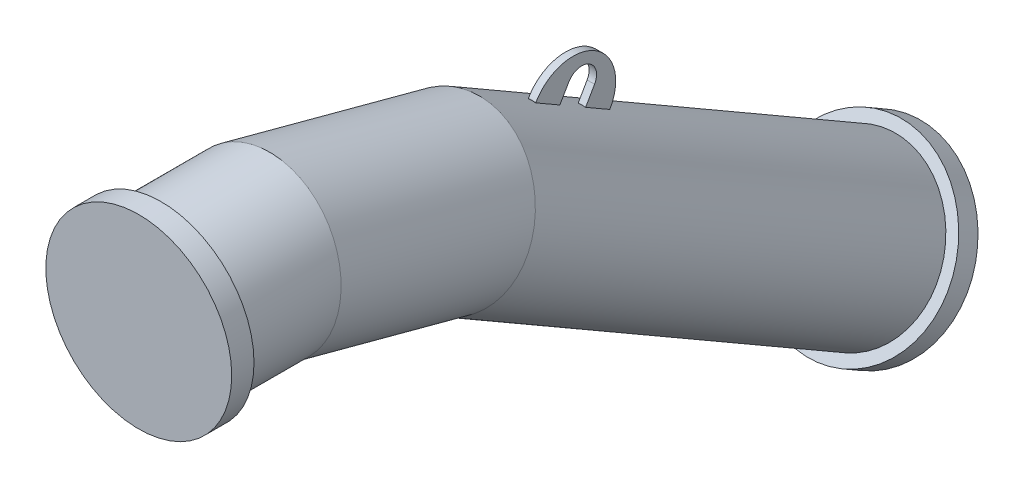
ISO-10303-21;
HEADER;
FILE_DESCRIPTION(('STEP AP214'),'2;1');
FILE_NAME('part.step','',(''),(''),'','','');
FILE_SCHEMA(('AUTOMOTIVE_DESIGN { 1 0 10303 214 1 1 1 1 }'));
ENDSEC;
DATA;
#1=APPLICATION_CONTEXT('core data for automotive mechanical design processes');
#2=APPLICATION_PROTOCOL_DEFINITION('international standard','automotive_design',2000,#1);
#3=PRODUCT_CONTEXT('',#1,'mechanical');
#4=PRODUCT('Part','Part','',(#3));
#5=PRODUCT_RELATED_PRODUCT_CATEGORY('part','',(#4));
#6=PRODUCT_DEFINITION_FORMATION('','',#4);
#7=PRODUCT_DEFINITION_CONTEXT('part definition',#1,'design');
#8=PRODUCT_DEFINITION('design','',#6,#7);
#9=PRODUCT_DEFINITION_SHAPE('','',#8);
#10=(LENGTH_UNIT() NAMED_UNIT(*) SI_UNIT(.MILLI.,.METRE.));
#11=(NAMED_UNIT(*) PLANE_ANGLE_UNIT() SI_UNIT($,.RADIAN.));
#12=(NAMED_UNIT(*) SI_UNIT($,.STERADIAN.) SOLID_ANGLE_UNIT());
#13=UNCERTAINTY_MEASURE_WITH_UNIT(LENGTH_MEASURE(1.E-05),#10,'distance_accuracy_value','');
#14=(GEOMETRIC_REPRESENTATION_CONTEXT(3) GLOBAL_UNCERTAINTY_ASSIGNED_CONTEXT((#13)) GLOBAL_UNIT_ASSIGNED_CONTEXT((#10,
#11,#12)) REPRESENTATION_CONTEXT('',''));
#15=CARTESIAN_POINT('',(0.,0.,0.));
#16=DIRECTION('',(0.,0.,1.));
#17=DIRECTION('',(1.,0.,0.));
#18=AXIS2_PLACEMENT_3D('',#15,#16,#17);
#19=CARTESIAN_POINT('',(0.,0.,0.));
#20=DIRECTION('',(0.,0.,1.));
#21=DIRECTION('',(1.,0.,0.));
#22=AXIS2_PLACEMENT_3D('',#19,#20,#21);
#23=PLANE('',#22);
#24=CARTESIAN_POINT('',(0.,0.,0.));
#25=DIRECTION('',(0.,0.,1.));
#26=DIRECTION('',(1.,0.,0.));
#27=AXIS2_PLACEMENT_3D('',#24,#25,#26);
#28=CIRCLE('',#27,125.);
#29=CARTESIAN_POINT('',(125.,0.,0.));
#30=VERTEX_POINT('',#29);
#31=EDGE_CURVE('E21',#30,#30,#28,.T.);
#32=ORIENTED_EDGE('',*,*,#31,.T.);
#33=EDGE_LOOP('',(#32));
#34=FACE_BOUND('',#33,.T.);
#35=ADVANCED_FACE('F17',(#34),#23,.T.);
#36=CARTESIAN_POINT('',(0.,-3.33066907387547E-13,-30.0000000000004));
#37=DIRECTION('',(0.,0.,1.));
#38=DIRECTION('',(1.,0.,0.));
#39=AXIS2_PLACEMENT_3D('',#36,#37,#38);
#40=CYLINDRICAL_SURFACE('',#39,125.);
#41=CARTESIAN_POINT('',(0.,-3.33066907387547E-13,-30.0000000000004));
#42=DIRECTION('',(0.,0.,1.));
#43=DIRECTION('',(1.,0.,0.));
#44=AXIS2_PLACEMENT_3D('',#41,#42,#43);
#45=CIRCLE('',#44,125.);
#46=CARTESIAN_POINT('',(125.,-3.65253148460731E-13,-30.0000000000004));
#47=VERTEX_POINT('',#46);
#48=EDGE_CURVE('E28',#47,#47,#45,.T.);
#49=ORIENTED_EDGE('',*,*,#48,.T.);
#50=EDGE_LOOP('',(#49));
#51=FACE_BOUND('',#50,.T.);
#52=ORIENTED_EDGE('',*,*,#31,.F.);
#53=EDGE_LOOP('',(#52));
#54=FACE_BOUND('',#53,.T.);
#55=ADVANCED_FACE('F19',(#51,#54),#40,.T.);
#56=CARTESIAN_POINT('',(0.,-3.33066907387547E-13,-30.0000000000004));
#57=DIRECTION('',(0.,0.,1.));
#58=DIRECTION('',(1.,0.,0.));
#59=AXIS2_PLACEMENT_3D('',#56,#57,#58);
#60=PLANE('',#59);
#61=CARTESIAN_POINT('',(0.,0.,-30.));
#62=DIRECTION('',(0.,0.,-1.));
#63=DIRECTION('',(-1.,0.,0.));
#64=AXIS2_PLACEMENT_3D('',#61,#62,#63);
#65=CIRCLE('',#64,109.55);
#66=CARTESIAN_POINT('',(-109.55,0.,-30.));
#67=VERTEX_POINT('',#66);
#68=EDGE_CURVE('E10',#67,#67,#65,.T.);
#69=ORIENTED_EDGE('',*,*,#68,.F.);
#70=EDGE_LOOP('',(#69));
#71=FACE_BOUND('',#70,.T.);
#72=ORIENTED_EDGE('',*,*,#48,.F.);
#73=EDGE_LOOP('',(#72));
#74=FACE_BOUND('',#73,.T.);
#75=ADVANCED_FACE('F390',(#71,#74),#60,.F.);
#76=CARTESIAN_POINT('',(5.00000000000025,-14.8602048103285,-590.687822173513));
#77=DIRECTION('',(1.,0.,0.));
#78=DIRECTION('',(0.,0.866025403784438,-0.500000000000001));
#79=AXIS2_PLACEMENT_3D('',#76,#77,#78);
#80=PLANE('',#79);
#81=DIRECTION('',(0.,0.866025403784438,-0.500000000000001));
#82=VECTOR('',#81,1.);
#83=CARTESIAN_POINT('',(5.00000000000026,-15.1220558371067,-524.141361455907));
#84=LINE('',#83,#82);
#85=CARTESIAN_POINT('',(5.00000000000026,-6.95038097216386,-528.859280138912));
#86=VERTEX_POINT('',#85);
#87=CARTESIAN_POINT('',(5.00000000000026,-6.46180179926234,-529.141361455907));
#88=VERTEX_POINT('',#87);
#89=EDGE_CURVE('E317',#86,#88,#84,.T.);
#90=ORIENTED_EDGE('',*,*,#89,.F.);
#91=DIRECTION('',(0.,-0.499999999999995,-0.866025403784429));
#92=VECTOR('',#91,1.);
#93=CARTESIAN_POINT('',(5.00000000000012,-223.374132178468,-903.716213192874));
#94=LINE('',#93,#92);
#95=CARTESIAN_POINT('',(5.00000000000024,-25.7003809721672,-561.335232780832));
#96=VERTEX_POINT('',#95);
#97=EDGE_CURVE('E53',#86,#96,#94,.T.);
#98=ORIENTED_EDGE('',*,*,#97,.T.);
#99=DIRECTION('',(0.,0.866025403784439,-0.500000000000002));
#100=VECTOR('',#99,1.);
#101=CARTESIAN_POINT('',(5.00000000000025,-25.2118017992627,-561.617314097824));
#102=LINE('',#101,#100);
#103=CARTESIAN_POINT('',(5.00000000000025,-4.86020481032828,-573.367314097824));
#104=VERTEX_POINT('',#103);
#105=EDGE_CURVE('E330',#96,#104,#102,.T.);
#106=ORIENTED_EDGE('',*,*,#105,.T.);
#107=CARTESIAN_POINT('',(5.00000000000025,-14.8602048103285,-590.687822173513));
#108=DIRECTION('',(-1.,0.,0.));
#109=DIRECTION('',(0.,0.866025403784438,-0.500000000000001));
#110=AXIS2_PLACEMENT_3D('',#107,#108,#109);
#111=CIRCLE('',#110,20.);
#112=CARTESIAN_POINT('',(5.00000000000023,-24.8602048103283,-608.008330249202));
#113=VERTEX_POINT('',#112);
#114=EDGE_CURVE('E333',#104,#113,#111,.T.);
#115=ORIENTED_EDGE('',*,*,#114,.T.);
#116=DIRECTION('',(0.,-0.866025403784438,0.500000000000001));
#117=VECTOR('',#116,1.);
#118=CARTESIAN_POINT('',(5.00000000000023,-45.2118017992629,-596.258330249202));
#119=LINE('',#118,#117);
#120=CARTESIAN_POINT('',(5.00000000000022,-45.7003809721671,-595.976248932209));
#121=VERTEX_POINT('',#120);
#122=EDGE_CURVE('E337',#113,#121,#119,.T.);
#123=ORIENTED_EDGE('',*,*,#122,.T.);
#124=CARTESIAN_POINT('',(5.00000000000023,-64.4503809721643,-628.452201574123));
#125=VERTEX_POINT('',#124);
#126=EDGE_CURVE('E307',#121,#125,#94,.T.);
#127=ORIENTED_EDGE('',*,*,#126,.T.);
#128=DIRECTION('',(0.,0.866025403784438,-0.500000000000001));
#129=VECTOR('',#128,1.);
#130=CARTESIAN_POINT('',(5.00000000000023,-72.6220558371072,-623.734282891118));
#131=LINE('',#130,#129);
#132=CARTESIAN_POINT('',(5.00000000000023,-63.9618017992628,-628.734282891118));
#133=VERTEX_POINT('',#132);
#134=EDGE_CURVE('E323',#125,#133,#131,.T.);
#135=ORIENTED_EDGE('',*,*,#134,.T.);
#136=CARTESIAN_POINT('',(5.00000000000024,-35.2118017992626,-578.937822173513));
#137=DIRECTION('',(1.,0.,0.));
#138=DIRECTION('',(0.,0.866025403784438,-0.500000000000001));
#139=AXIS2_PLACEMENT_3D('',#136,#137,#138);
#140=CIRCLE('',#139,57.5);
#141=EDGE_CURVE('E340',#133,#88,#140,.T.);
#142=ORIENTED_EDGE('',*,*,#141,.T.);
#143=EDGE_LOOP('',(#90,#98,#106,#115,#123,#127,#135,#142));
#144=FACE_BOUND('',#143,.T.);
#145=ADVANCED_FACE('F396',(#144),#80,.T.);
#146=CARTESIAN_POINT('',(-4.99999999999976,-14.8602048103285,-590.687822173513));
#147=DIRECTION('',(1.,0.,0.));
#148=DIRECTION('',(0.,0.866025403784438,-0.500000000000001));
#149=AXIS2_PLACEMENT_3D('',#146,#147,#148);
#150=PLANE('',#149);
#151=DIRECTION('',(0.,-0.499999999999995,-0.866025403784429));
#152=VECTOR('',#151,1.);
#153=CARTESIAN_POINT('',(-4.99999999999988,-223.374132178468,-903.716213192874));
#154=LINE('',#153,#152);
#155=CARTESIAN_POINT('',(-4.99999999999974,-6.95038097216381,-528.859280138912));
#156=VERTEX_POINT('',#155);
#157=CARTESIAN_POINT('',(-4.99999999999976,-25.7003809721672,-561.335232780832));
#158=VERTEX_POINT('',#157);
#159=EDGE_CURVE('E299',#156,#158,#154,.T.);
#160=ORIENTED_EDGE('',*,*,#159,.F.);
#161=DIRECTION('',(0.,0.866025403784438,-0.500000000000001));
#162=VECTOR('',#161,1.);
#163=CARTESIAN_POINT('',(-4.99999999999974,-15.1220558371067,-524.141361455907));
#164=LINE('',#163,#162);
#165=CARTESIAN_POINT('',(-4.99999999999974,-6.46180179926234,-529.141361455907));
#166=VERTEX_POINT('',#165);
#167=EDGE_CURVE('E320',#156,#166,#164,.T.);
#168=ORIENTED_EDGE('',*,*,#167,.T.);
#169=CARTESIAN_POINT('',(-4.99999999999976,-35.2118017992626,-578.937822173513));
#170=DIRECTION('',(1.,0.,0.));
#171=DIRECTION('',(0.,0.866025403784438,-0.500000000000001));
#172=AXIS2_PLACEMENT_3D('',#169,#170,#171);
#173=CIRCLE('',#172,57.5);
#174=CARTESIAN_POINT('',(-4.99999999999977,-63.9618017992628,-628.734282891118));
#175=VERTEX_POINT('',#174);
#176=EDGE_CURVE('E334',#175,#166,#173,.T.);
#177=ORIENTED_EDGE('',*,*,#176,.F.);
#178=DIRECTION('',(0.,0.866025403784438,-0.500000000000001));
#179=VECTOR('',#178,1.);
#180=CARTESIAN_POINT('',(-4.99999999999977,-72.6220558371072,-623.734282891118));
#181=LINE('',#180,#179);
#182=CARTESIAN_POINT('',(-4.99999999999977,-64.4503809721642,-628.452201574123));
#183=VERTEX_POINT('',#182);
#184=EDGE_CURVE('E326',#183,#175,#181,.T.);
#185=ORIENTED_EDGE('',*,*,#184,.F.);
#186=CARTESIAN_POINT('',(-4.99999999999978,-45.7003809721671,-595.976248932209));
#187=VERTEX_POINT('',#186);
#188=EDGE_CURVE('E303',#187,#183,#154,.T.);
#189=ORIENTED_EDGE('',*,*,#188,.F.);
#190=DIRECTION('',(0.,-0.866025403784438,0.500000000000001));
#191=VECTOR('',#190,1.);
#192=CARTESIAN_POINT('',(-4.99999999999977,-45.2118017992629,-596.258330249202));
#193=LINE('',#192,#191);
#194=CARTESIAN_POINT('',(-4.99999999999977,-24.8602048103283,-608.008330249202));
#195=VERTEX_POINT('',#194);
#196=EDGE_CURVE('E350',#195,#187,#193,.T.);
#197=ORIENTED_EDGE('',*,*,#196,.F.);
#198=CARTESIAN_POINT('',(-4.99999999999976,-14.8602048103285,-590.687822173513));
#199=DIRECTION('',(-1.,0.,0.));
#200=DIRECTION('',(0.,0.866025403784438,-0.500000000000001));
#201=AXIS2_PLACEMENT_3D('',#198,#199,#200);
#202=CIRCLE('',#201,20.);
#203=CARTESIAN_POINT('',(-4.99999999999975,-4.86020481032834,-573.367314097824));
#204=VERTEX_POINT('',#203);
#205=EDGE_CURVE('E347',#204,#195,#202,.T.);
#206=ORIENTED_EDGE('',*,*,#205,.F.);
#207=DIRECTION('',(0.,0.866025403784439,-0.500000000000002));
#208=VECTOR('',#207,1.);
#209=CARTESIAN_POINT('',(-4.99999999999975,-25.2118017992627,-561.617314097824));
#210=LINE('',#209,#208);
#211=EDGE_CURVE('E329',#158,#204,#210,.T.);
#212=ORIENTED_EDGE('',*,*,#211,.F.);
#213=EDGE_LOOP('',(#160,#168,#177,#185,#189,#197,#206,#212));
#214=FACE_BOUND('',#213,.T.);
#215=ADVANCED_FACE('F406',(#214),#150,.F.);
#216=CARTESIAN_POINT('',(5.00000000000025,-25.2118017992627,-561.617314097824));
#217=DIRECTION('',(0.,0.500000000000002,0.866025403784439));
#218=DIRECTION('',(0.,-0.866025403784439,0.500000000000002));
#219=AXIS2_PLACEMENT_3D('',#216,#217,#218);
#220=PLANE('',#219);
#221=CARTESIAN_POINT('',(-1.42014403945222E-13,-120.474596215552,-506.617314097823));
#222=DIRECTION('',(0.,0.500000000000002,0.866025403784439));
#223=DIRECTION('',(0.,-0.866025403784438,0.500000000000001));
#224=AXIS2_PLACEMENT_3D('',#221,#222,#223);
#225=CIRCLE('',#224,109.55);
#226=EDGE_CURVE('E306',#158,#96,#225,.F.);
#227=ORIENTED_EDGE('',*,*,#226,.F.);
#228=ORIENTED_EDGE('',*,*,#211,.T.);
#229=DIRECTION('',(-1.,0.,0.));
#230=VECTOR('',#229,1.);
#231=CARTESIAN_POINT('',(5.00000000000025,-4.86020481032828,-573.367314097824));
#232=LINE('',#231,#230);
#233=EDGE_CURVE('E367',#104,#204,#232,.T.);
#234=ORIENTED_EDGE('',*,*,#233,.F.);
#235=ORIENTED_EDGE('',*,*,#105,.F.);
#236=EDGE_LOOP('',(#227,#228,#234,#235));
#237=FACE_BOUND('',#236,.T.);
#238=ADVANCED_FACE('F402',(#237),#220,.F.);
#239=CARTESIAN_POINT('',(5.00000000000025,-14.8602048103285,-590.687822173513));
#240=DIRECTION('',(-1.,0.,0.));
#241=DIRECTION('',(0.,-0.866025403784438,0.500000000000001));
#242=AXIS2_PLACEMENT_3D('',#239,#240,#241);
#243=CYLINDRICAL_SURFACE('',#242,20.);
#244=ORIENTED_EDGE('',*,*,#205,.T.);
#245=DIRECTION('',(-1.,0.,0.));
#246=VECTOR('',#245,1.);
#247=CARTESIAN_POINT('',(5.00000000000023,-24.8602048103283,-608.008330249202));
#248=LINE('',#247,#246);
#249=EDGE_CURVE('E363',#113,#195,#248,.T.);
#250=ORIENTED_EDGE('',*,*,#249,.F.);
#251=ORIENTED_EDGE('',*,*,#114,.F.);
#252=ORIENTED_EDGE('',*,*,#233,.T.);
#253=EDGE_LOOP('',(#244,#250,#251,#252));
#254=FACE_BOUND('',#253,.T.);
#255=ADVANCED_FACE('F405',(#254),#243,.F.);
#256=CARTESIAN_POINT('',(5.00000000000023,-45.2118017992629,-596.258330249202));
#257=DIRECTION('',(0.,-0.500000000000001,-0.866025403784438));
#258=DIRECTION('',(0.,0.866025403784438,-0.500000000000001));
#259=AXIS2_PLACEMENT_3D('',#256,#257,#258);
#260=PLANE('',#259);
#261=CARTESIAN_POINT('',(-1.52674128869724E-13,-140.474596215552,-541.258330249201));
#262=DIRECTION('',(0.,-0.500000000000001,-0.866025403784438));
#263=DIRECTION('',(0.,0.866025403784438,-0.500000000000001));
#264=AXIS2_PLACEMENT_3D('',#261,#262,#263);
#265=CIRCLE('',#264,109.55);
#266=EDGE_CURVE('E41',#121,#187,#265,.F.);
#267=ORIENTED_EDGE('',*,*,#266,.F.);
#268=ORIENTED_EDGE('',*,*,#122,.F.);
#269=ORIENTED_EDGE('',*,*,#249,.T.);
#270=ORIENTED_EDGE('',*,*,#196,.T.);
#271=EDGE_LOOP('',(#267,#268,#269,#270));
#272=FACE_BOUND('',#271,.T.);
#273=ADVANCED_FACE('F410',(#272),#260,.F.);
#274=CARTESIAN_POINT('',(5.00000000000024,-35.2118017992626,-578.937822173513));
#275=DIRECTION('',(-1.,0.,0.));
#276=DIRECTION('',(0.,-0.866025403784438,0.500000000000001));
#277=AXIS2_PLACEMENT_3D('',#274,#275,#276);
#278=CYLINDRICAL_SURFACE('',#277,57.5);
#279=ORIENTED_EDGE('',*,*,#176,.T.);
#280=DIRECTION('',(-1.,0.,0.));
#281=VECTOR('',#280,1.);
#282=CARTESIAN_POINT('',(5.00000000000026,-6.46180179926234,-529.141361455907));
#283=LINE('',#282,#281);
#284=EDGE_CURVE('E344',#88,#166,#283,.T.);
#285=ORIENTED_EDGE('',*,*,#284,.F.);
#286=ORIENTED_EDGE('',*,*,#141,.F.);
#287=DIRECTION('',(-1.,0.,0.));
#288=VECTOR('',#287,1.);
#289=CARTESIAN_POINT('',(5.00000000000023,-63.9618017992628,-628.734282891118));
#290=LINE('',#289,#288);
#291=EDGE_CURVE('E359',#133,#175,#290,.T.);
#292=ORIENTED_EDGE('',*,*,#291,.T.);
#293=EDGE_LOOP('',(#279,#285,#286,#292));
#294=FACE_BOUND('',#293,.T.);
#295=ADVANCED_FACE('F414',(#294),#278,.T.);
#296=CARTESIAN_POINT('',(-4.99999999999977,-72.6220558371072,-623.734282891118));
#297=DIRECTION('',(0.,0.500000000000001,0.866025403784438));
#298=DIRECTION('',(0.,-0.866025403784438,0.500000000000001));
#299=AXIS2_PLACEMENT_3D('',#296,#297,#298);
#300=PLANE('',#299);
#301=CARTESIAN_POINT('',(-1.62667620986445E-13,-159.224596215552,-573.734282891117));
#302=DIRECTION('',(0.,0.500000000000001,0.866025403784438));
#303=DIRECTION('',(0.,-0.866025403784438,0.500000000000001));
#304=AXIS2_PLACEMENT_3D('',#301,#302,#303);
#305=CIRCLE('',#304,109.55);
#306=EDGE_CURVE('E311',#183,#125,#305,.F.);
#307=ORIENTED_EDGE('',*,*,#306,.F.);
#308=ORIENTED_EDGE('',*,*,#184,.T.);
#309=ORIENTED_EDGE('',*,*,#291,.F.);
#310=ORIENTED_EDGE('',*,*,#134,.F.);
#311=EDGE_LOOP('',(#307,#308,#309,#310));
#312=FACE_BOUND('',#311,.T.);
#313=ADVANCED_FACE('F417',(#312),#300,.F.);
#314=CARTESIAN_POINT('',(5.00000000000026,-15.1220558371067,-524.141361455907));
#315=DIRECTION('',(0.,-0.500000000000001,-0.866025403784438));
#316=DIRECTION('',(0.,0.866025403784438,-0.500000000000001));
#317=AXIS2_PLACEMENT_3D('',#314,#315,#316);
#318=PLANE('',#317);
#319=CARTESIAN_POINT('',(-1.32020911828501E-13,-101.724596215552,-474.141361455906));
#320=DIRECTION('',(0.,-0.500000000000001,-0.866025403784438));
#321=DIRECTION('',(0.,0.866025403784438,-0.500000000000001));
#322=AXIS2_PLACEMENT_3D('',#319,#320,#321);
#323=CIRCLE('',#322,109.55);
#324=EDGE_CURVE('E371',#86,#156,#323,.F.);
#325=ORIENTED_EDGE('',*,*,#324,.F.);
#326=ORIENTED_EDGE('',*,*,#89,.T.);
#327=ORIENTED_EDGE('',*,*,#284,.T.);
#328=ORIENTED_EDGE('',*,*,#167,.F.);
#329=EDGE_LOOP('',(#325,#326,#327,#328));
#330=FACE_BOUND('',#329,.T.);
#331=ADVANCED_FACE('F426',(#330),#318,.F.);
#332=CARTESIAN_POINT('',(-2.47371794577906E-13,-318.148347421854,-848.998294509869));
#333=DIRECTION('',(0.,-0.499999999999995,-0.866025403784429));
#334=DIRECTION('',(-1.,0.,0.));
#335=AXIS2_PLACEMENT_3D('',#332,#333,#334);
#336=CYLINDRICAL_SURFACE('',#335,109.55);
#337=CARTESIAN_POINT('',(-2.82456279825538E-13,-383.974596215551,-963.012701892223));
#338=DIRECTION('',(0.,0.499999999999995,0.866025403784429));
#339=DIRECTION('',(1.,0.,0.));
#340=AXIS2_PLACEMENT_3D('',#337,#338,#339);
#341=CIRCLE('',#340,109.55);
#342=CARTESIAN_POINT('',(109.55,-383.974596215552,-963.012701892223));
#343=VERTEX_POINT('',#342);
#344=EDGE_CURVE('E284',#343,#343,#341,.T.);
#345=ORIENTED_EDGE('',*,*,#344,.T.);
#346=EDGE_LOOP('',(#345));
#347=FACE_BOUND('',#346,.T.);
#348=CARTESIAN_POINT('',(0.,-68.1483474218638,-415.985592617647));
#349=DIRECTION('',(0.,-0.38268343236509,-0.923879532511287));
#350=DIRECTION('',(0.,-0.923879532511287,0.38268343236509));
#351=AXIS2_PLACEMENT_3D('',#348,#349,#350);
#352=ELLIPSE('',#351,110.495302631556,109.55);
#353=CARTESIAN_POINT('',(0.,-170.232695961799,-373.700870946383));
#354=VERTEX_POINT('',#353);
#355=EDGE_CURVE('E291',#354,#354,#352,.T.);
#356=ORIENTED_EDGE('',*,*,#355,.T.);
#357=EDGE_LOOP('',(#356));
#358=FACE_BOUND('',#357,.T.);
#359=ORIENTED_EDGE('',*,*,#159,.T.);
#360=ORIENTED_EDGE('',*,*,#226,.T.);
#361=ORIENTED_EDGE('',*,*,#97,.F.);
#362=ORIENTED_EDGE('',*,*,#324,.T.);
#363=EDGE_LOOP('',(#359,#360,#361,#362));
#364=FACE_BOUND('',#363,.T.);
#365=ORIENTED_EDGE('',*,*,#126,.F.);
#366=ORIENTED_EDGE('',*,*,#266,.T.);
#367=ORIENTED_EDGE('',*,*,#188,.T.);
#368=ORIENTED_EDGE('',*,*,#306,.T.);
#369=EDGE_LOOP('',(#365,#366,#367,#368));
#370=FACE_BOUND('',#369,.T.);
#371=ADVANCED_FACE('F430',(#347,#358,#364,#370),#336,.T.);
#372=CARTESIAN_POINT('',(0.,0.,-161.652497587396));
#373=DIRECTION('',(0.,0.,1.));
#374=DIRECTION('',(1.,0.,0.));
#375=AXIS2_PLACEMENT_3D('',#372,#373,#374);
#376=CYLINDRICAL_SURFACE('',#375,109.55);
#377=ORIENTED_EDGE('',*,*,#68,.T.);
#378=EDGE_LOOP('',(#377));
#379=FACE_BOUND('',#378,.T.);
#380=CARTESIAN_POINT('',(0.,0.,-161.652497587396));
#381=DIRECTION('',(0.,-0.130526192220052,-0.99144486137381));
#382=DIRECTION('',(0.,-0.99144486137381,0.130526192220052));
#383=AXIS2_PLACEMENT_3D('',#380,#381,#382);
#384=ELLIPSE('',#383,110.495302631556,109.55);
#385=CARTESIAN_POINT('',(0.,-109.55,-147.229966476697));
#386=VERTEX_POINT('',#385);
#387=EDGE_CURVE('E294',#386,#386,#384,.T.);
#388=ORIENTED_EDGE('',*,*,#387,.F.);
#389=EDGE_LOOP('',(#388));
#390=FACE_BOUND('',#389,.T.);
#391=ADVANCED_FACE('F432',(#379,#390),#376,.T.);
#392=CARTESIAN_POINT('',(0.,-68.1483474218638,-415.985592617647));
#393=DIRECTION('',(0.,0.258819045102521,0.965925826289068));
#394=DIRECTION('',(0.,-0.965925826289068,0.258819045102521));
#395=AXIS2_PLACEMENT_3D('',#392,#393,#394);
#396=CYLINDRICAL_SURFACE('',#395,109.55);
#397=ORIENTED_EDGE('',*,*,#355,.F.);
#398=EDGE_LOOP('',(#397));
#399=FACE_BOUND('',#398,.T.);
#400=ORIENTED_EDGE('',*,*,#387,.T.);
#401=EDGE_LOOP('',(#400));
#402=FACE_BOUND('',#401,.T.);
#403=ADVANCED_FACE('F435',(#399,#402),#396,.T.);
#404=CARTESIAN_POINT('',(-2.61312604657219E-13,-383.97459621555,-963.012701892224));
#405=DIRECTION('',(0.,-0.500000000000002,-0.866025403784442));
#406=DIRECTION('',(1.,0.,0.));
#407=AXIS2_PLACEMENT_3D('',#404,#405,#406);
#408=CYLINDRICAL_SURFACE('',#407,125.);
#409=CARTESIAN_POINT('',(-2.61312604657219E-13,-383.97459621555,-963.012701892224));
#410=DIRECTION('',(0.,-0.500000000000002,-0.866025403784442));
#411=DIRECTION('',(1.,0.,0.));
#412=AXIS2_PLACEMENT_3D('',#409,#410,#411);
#413=CIRCLE('',#412,125.);
#414=CARTESIAN_POINT('',(125.,-383.97459621555,-963.012701892224));
#415=VERTEX_POINT('',#414);
#416=EDGE_CURVE('E280',#415,#415,#413,.T.);
#417=ORIENTED_EDGE('',*,*,#416,.T.);
#418=EDGE_LOOP('',(#417));
#419=FACE_BOUND('',#418,.T.);
#420=CARTESIAN_POINT('',(-2.69190720448067E-13,-398.974596215551,-988.993464005757));
#421=DIRECTION('',(0.,-0.500000000000002,-0.866025403784442));
#422=DIRECTION('',(1.,0.,0.));
#423=AXIS2_PLACEMENT_3D('',#420,#421,#422);
#424=CIRCLE('',#423,125.);
#425=CARTESIAN_POINT('',(125.,-398.974596215551,-988.993464005757));
#426=VERTEX_POINT('',#425);
#427=EDGE_CURVE('E279',#426,#426,#424,.T.);
#428=ORIENTED_EDGE('',*,*,#427,.F.);
#429=EDGE_LOOP('',(#428));
#430=FACE_BOUND('',#429,.T.);
#431=ADVANCED_FACE('F439',(#419,#430),#408,.T.);
#432=CARTESIAN_POINT('',(-2.61312604657219E-13,-383.97459621555,-963.012701892224));
#433=DIRECTION('',(0.,-0.500000000000002,-0.866025403784442));
#434=DIRECTION('',(1.,0.,0.));
#435=AXIS2_PLACEMENT_3D('',#432,#433,#434);
#436=PLANE('',#435);
#437=ORIENTED_EDGE('',*,*,#344,.F.);
#438=EDGE_LOOP('',(#437));
#439=FACE_BOUND('',#438,.T.);
#440=ORIENTED_EDGE('',*,*,#416,.F.);
#441=EDGE_LOOP('',(#440));
#442=FACE_BOUND('',#441,.T.);
#443=ADVANCED_FACE('F446',(#439,#442),#436,.F.);
#444=CARTESIAN_POINT('',(-2.69190720448067E-13,-398.974596215551,-988.993464005757));
#445=DIRECTION('',(0.,-0.500000000000002,-0.866025403784442));
#446=DIRECTION('',(1.,0.,0.));
#447=AXIS2_PLACEMENT_3D('',#444,#445,#446);
#448=PLANE('',#447);
#449=ORIENTED_EDGE('',*,*,#427,.T.);
#450=EDGE_LOOP('',(#449));
#451=FACE_BOUND('',#450,.T.);
#452=ADVANCED_FACE('F448',(#451),#448,.T.);
#453=CLOSED_SHELL('',(#35,#55,#75,#145,#215,#238,#255,#273,#295,#313,#331,#371,#391,#403,#431,
#443,#452));
#454=CARTESIAN_POINT('',(-2.62625623955694E-13,-386.474596215551,-967.342828911146));
#455=DIRECTION('',(0.,-0.5,-0.866025403784439));
#456=DIRECTION('',(0.,0.866025403784438,-0.5));
#457=AXIS2_PLACEMENT_3D('',#454,#455,#456);
#458=PLANE('',#457);
#459=CARTESIAN_POINT('',(-2.62625623955694E-13,-386.474596215551,-967.342828911146));
#460=DIRECTION('',(0.,-0.5,-0.866025403784439));
#461=DIRECTION('',(0.,0.866025403784438,-0.5));
#462=AXIS2_PLACEMENT_3D('',#459,#460,#461);
#463=CIRCLE('',#462,62.5);
#464=CARTESIAN_POINT('',(-2.62625623955694E-13,-332.348008479023,-998.592828911146));
#465=VERTEX_POINT('',#464);
#466=EDGE_CURVE('E264',#465,#465,#463,.F.);
#467=ORIENTED_EDGE('',*,*,#466,.T.);
#468=EDGE_LOOP('',(#467));
#469=FACE_BOUND('',#468,.T.);
#470=ADVANCED_FACE('F471',(#469),#458,.F.);
#471=CARTESIAN_POINT('',(0.,-3.33066907387547E-13,-30.0000000000004));
#472=DIRECTION('',(0.,0.,1.));
#473=DIRECTION('',(1.,0.,0.));
#474=AXIS2_PLACEMENT_3D('',#471,#472,#473);
#475=PLANE('',#474);
#476=CARTESIAN_POINT('',(0.,-3.33066907387547E-13,-30.0000000000004));
#477=DIRECTION('',(0.,0.,1.));
#478=DIRECTION('',(1.,0.,0.));
#479=AXIS2_PLACEMENT_3D('',#476,#477,#478);
#480=CIRCLE('',#479,62.5);
#481=CARTESIAN_POINT('',(62.5,-3.49160027924139E-13,-30.0000000000004));
#482=VERTEX_POINT('',#481);
#483=EDGE_CURVE('E205',#482,#482,#480,.T.);
#484=ORIENTED_EDGE('',*,*,#483,.T.);
#485=EDGE_LOOP('',(#484));
#486=FACE_BOUND('',#485,.T.);
#487=CARTESIAN_POINT('',(0.,0.,-30.));
#488=DIRECTION('',(0.,0.,-0.999999999999997));
#489=DIRECTION('',(0.,1.,0.));
#490=AXIS2_PLACEMENT_3D('',#487,#488,#489);
#491=CIRCLE('',#490,63.5);
#492=CARTESIAN_POINT('',(0.,63.499999999995,-30.));
#493=VERTEX_POINT('',#492);
#494=EDGE_CURVE('E259',#493,#493,#491,.T.);
#495=ORIENTED_EDGE('',*,*,#494,.T.);
#496=EDGE_LOOP('',(#495));
#497=FACE_BOUND('',#496,.T.);
#498=ADVANCED_FACE('F459',(#486,#497),#475,.F.);
#499=CARTESIAN_POINT('',(0.,-1000.,-29.9999999999994));
#500=DIRECTION('',(-1.,0.,0.));
#501=DIRECTION('',(0.,0.,0.999999999999997));
#502=AXIS2_PLACEMENT_3D('',#499,#500,#501);
#503=TOROIDAL_SURFACE('',#502,1000.,63.5);
#504=CARTESIAN_POINT('',(0.,-133.974596215561,-529.999999999999));
#505=DIRECTION('',(0.,0.5,0.866025403784435));
#506=DIRECTION('',(0.,0.86602540378444,-0.500000000000004));
#507=AXIS2_PLACEMENT_3D('',#504,#505,#506);
#508=CIRCLE('',#507,63.5);
#509=CARTESIAN_POINT('',(0.,-78.9819830752533,-561.749999999997));
#510=VERTEX_POINT('',#509);
#511=EDGE_CURVE('E269',#510,#510,#508,.T.);
#512=CARTESIAN_POINT('',(0.,-1000.,-29.9999999999994));
#513=DIRECTION('',(-1.,0.,0.));
#514=DIRECTION('',(0.,0.,0.999999999999997));
#515=AXIS2_PLACEMENT_3D('',#512,#513,#514);
#516=CIRCLE('',#515,1063.5);
#517=EDGE_CURVE('',#493,#510,#516,.T.);
#518=ORIENTED_EDGE('',*,*,#494,.F.);
#519=ORIENTED_EDGE('',*,*,#511,.F.);
#520=ORIENTED_EDGE('',*,*,#517,.T.);
#521=ORIENTED_EDGE('',*,*,#517,.F.);
#522=EDGE_LOOP('',(#518,#520,#519,#521));
#523=FACE_BOUND('',#522,.T.);
#524=ADVANCED_FACE('F455',(#523),#503,.F.);
#525=CARTESIAN_POINT('',(-1.24506302033142E-13,-133.974596215551,-530.000000000004));
#526=DIRECTION('',(0.,-0.500000000000001,-0.866025403784437));
#527=DIRECTION('',(-0.999999999999999,0.,0.));
#528=AXIS2_PLACEMENT_3D('',#525,#526,#527);
#529=CYLINDRICAL_SURFACE('',#528,63.5);
#530=ORIENTED_EDGE('',*,*,#511,.T.);
#531=EDGE_LOOP('',(#530));
#532=FACE_BOUND('',#531,.T.);
#533=CARTESIAN_POINT('',(-2.44242952996274E-13,-383.974596215552,-963.012701892223));
#534=DIRECTION('',(0.,0.500000000000001,0.866025403784437));
#535=DIRECTION('',(0.999999999999999,0.,0.));
#536=AXIS2_PLACEMENT_3D('',#533,#534,#535);
#537=CIRCLE('',#536,63.5);
#538=CARTESIAN_POINT('',(63.4999999999997,-383.974596215552,-963.012701892223));
#539=VERTEX_POINT('',#538);
#540=EDGE_CURVE('E265',#539,#539,#537,.T.);
#541=ORIENTED_EDGE('',*,*,#540,.F.);
#542=EDGE_LOOP('',(#541));
#543=FACE_BOUND('',#542,.T.);
#544=ADVANCED_FACE('F458',(#532,#543),#529,.F.);
#545=CARTESIAN_POINT('',(-2.61312604657219E-13,-383.97459621555,-963.012701892224));
#546=DIRECTION('',(0.,-0.500000000000002,-0.866025403784442));
#547=DIRECTION('',(1.,0.,0.));
#548=AXIS2_PLACEMENT_3D('',#545,#546,#547);
#549=PLANE('',#548);
#550=CARTESIAN_POINT('',(-2.61312604657219E-13,-383.97459621555,-963.012701892224));
#551=DIRECTION('',(0.,-0.500000000000002,-0.866025403784442));
#552=DIRECTION('',(1.,0.,0.));
#553=AXIS2_PLACEMENT_3D('',#550,#551,#552);
#554=CIRCLE('',#553,62.5);
#555=CARTESIAN_POINT('',(62.4999999999997,-383.97459621555,-963.012701892224));
#556=VERTEX_POINT('',#555);
#557=EDGE_CURVE('E260',#556,#556,#554,.T.);
#558=ORIENTED_EDGE('',*,*,#557,.T.);
#559=EDGE_LOOP('',(#558));
#560=FACE_BOUND('',#559,.T.);
#561=ORIENTED_EDGE('',*,*,#540,.T.);
#562=EDGE_LOOP('',(#561));
#563=FACE_BOUND('',#562,.T.);
#564=ADVANCED_FACE('F464',(#560,#563),#549,.F.);
#565=CARTESIAN_POINT('',(-2.61312604657219E-13,-383.97459621555,-963.012701892224));
#566=DIRECTION('',(0.,-0.500000000000002,-0.866025403784442));
#567=DIRECTION('',(1.,0.,0.));
#568=AXIS2_PLACEMENT_3D('',#565,#566,#567);
#569=CYLINDRICAL_SURFACE('',#568,62.5);
#570=ORIENTED_EDGE('',*,*,#557,.F.);
#571=EDGE_LOOP('',(#570));
#572=FACE_BOUND('',#571,.T.);
#573=ORIENTED_EDGE('',*,*,#466,.F.);
#574=EDGE_LOOP('',(#573));
#575=FACE_BOUND('',#574,.T.);
#576=ADVANCED_FACE('F466',(#572,#575),#569,.F.);
#577=CARTESIAN_POINT('',(0.,0.,-25.));
#578=DIRECTION('',(0.,0.,1.));
#579=DIRECTION('',(1.,0.,0.));
#580=AXIS2_PLACEMENT_3D('',#577,#578,#579);
#581=PLANE('',#580);
#582=CARTESIAN_POINT('',(0.,-3.33066907387547E-13,-25.));
#583=DIRECTION('',(0.,0.,1.));
#584=DIRECTION('',(1.,0.,0.));
#585=AXIS2_PLACEMENT_3D('',#582,#583,#584);
#586=CIRCLE('',#585,62.5);
#587=CARTESIAN_POINT('',(62.5,-3.33066907387547E-13,-25.));
#588=VERTEX_POINT('',#587);
#589=EDGE_CURVE('E204',#588,#588,#586,.F.);
#590=ORIENTED_EDGE('',*,*,#589,.T.);
#591=EDGE_LOOP('',(#590));
#592=FACE_BOUND('',#591,.T.);
#593=ADVANCED_FACE('F469',(#592),#581,.F.);
#594=CARTESIAN_POINT('',(0.,-3.33066907387547E-13,-30.0000000000004));
#595=DIRECTION('',(0.,0.,1.));
#596=DIRECTION('',(1.,0.,0.));
#597=AXIS2_PLACEMENT_3D('',#594,#595,#596);
#598=CYLINDRICAL_SURFACE('',#597,62.5);
#599=ORIENTED_EDGE('',*,*,#483,.F.);
#600=EDGE_LOOP('',(#599));
#601=FACE_BOUND('',#600,.T.);
#602=ORIENTED_EDGE('',*,*,#589,.F.);
#603=EDGE_LOOP('',(#602));
#604=FACE_BOUND('',#603,.T.);
#605=ADVANCED_FACE('F613',(#601,#604),#598,.F.);
#606=CLOSED_SHELL('',(#470,#498,#524,#544,#564,#576,#593,#605));
#607=CARTESIAN_POINT('',(-97.0073509136853,-352.176170941813,-988.299734514098));
#608=DIRECTION('',(0.,-0.500000000000002,-0.866025403784442));
#609=DIRECTION('',(0.,0.866025403784439,-0.5));
#610=AXIS2_PLACEMENT_3D('',#607,#608,#609);
#611=PLANE('',#610);
#612=CARTESIAN_POINT('',(-97.0073509136853,-352.176170941813,-988.299734514098));
#613=DIRECTION('',(0.,-0.500000000000002,-0.866025403784442));
#614=DIRECTION('',(1.,0.,0.));
#615=AXIS2_PLACEMENT_3D('',#612,#613,#614);
#616=CIRCLE('',#615,6.99999999999999);
#617=CARTESIAN_POINT('',(-90.0073509136853,-352.176170941813,-988.299734514098));
#618=VERTEX_POINT('',#617);
#619=EDGE_CURVE('E216',#618,#618,#616,.T.);
#620=ORIENTED_EDGE('',*,*,#619,.F.);
#621=EDGE_LOOP('',(#620));
#622=FACE_BOUND('',#621,.T.);
#623=ADVANCED_FACE('F531',(#622),#611,.F.);
#624=CARTESIAN_POINT('',(-97.0073509136853,-352.176170941813,-988.299734514098));
#625=DIRECTION('',(0.,-0.500000000000002,-0.866025403784442));
#626=DIRECTION('',(1.,0.,0.));
#627=AXIS2_PLACEMENT_3D('',#624,#625,#626);
#628=CONICAL_SURFACE('',#627,6.99999999999999,1.02974425867665);
#629=CARTESIAN_POINT('',(-97.0073509136853,-350.073158775217,-984.657210592617));
#630=VERTEX_POINT('',#629);
#631=VERTEX_LOOP('',#630);
#632=FACE_BOUND('',#631,.T.);
#633=ORIENTED_EDGE('',*,*,#619,.T.);
#634=EDGE_LOOP('',(#633));
#635=FACE_BOUND('',#634,.T.);
#636=ADVANCED_FACE('F534',(#632,#635),#628,.F.);
#637=CLOSED_SHELL('',(#623,#636));
#638=CARTESIAN_POINT('',(-97.0073509136856,40.1817603983326,-24.0000000000009));
#639=DIRECTION('',(0.,0.,1.));
#640=DIRECTION('',(0.,-1.,0.));
#641=AXIS2_PLACEMENT_3D('',#638,#639,#640);
#642=PLANE('',#641);
#643=CARTESIAN_POINT('',(-97.0073509136856,40.1817603983326,-24.0000000000009));
#644=DIRECTION('',(0.,0.,1.));
#645=DIRECTION('',(1.,0.,0.));
#646=AXIS2_PLACEMENT_3D('',#643,#644,#645);
#647=CIRCLE('',#646,6.99999999999999);
#648=CARTESIAN_POINT('',(-90.0073509136856,40.1817603983326,-24.0000000000009));
#649=VERTEX_POINT('',#648);
#650=EDGE_CURVE('E233',#649,#649,#647,.T.);
#651=ORIENTED_EDGE('',*,*,#650,.F.);
#652=EDGE_LOOP('',(#651));
#653=FACE_BOUND('',#652,.T.);
#654=ADVANCED_FACE('F541',(#653),#642,.F.);
#655=CARTESIAN_POINT('',(-97.0073509136856,40.1817603983326,-24.0000000000009));
#656=DIRECTION('',(0.,0.,1.));
#657=DIRECTION('',(1.,0.,0.));
#658=AXIS2_PLACEMENT_3D('',#655,#656,#657);
#659=CONICAL_SURFACE('',#658,6.99999999999999,1.02974425867665);
#660=CARTESIAN_POINT('',(-97.0073509136856,40.1817603983329,-28.2060243331936));
#661=VERTEX_POINT('',#660);
#662=VERTEX_LOOP('',#661);
#663=FACE_BOUND('',#662,.T.);
#664=ORIENTED_EDGE('',*,*,#650,.T.);
#665=EDGE_LOOP('',(#664));
#666=FACE_BOUND('',#665,.T.);
#667=ADVANCED_FACE('F544',(#663,#666),#659,.F.);
#668=CLOSED_SHELL('',(#654,#667));
#669=CARTESIAN_POINT('',(-40.1817603983355,97.0073509136849,-24.0000000000002));
#670=DIRECTION('',(0.,0.,1.));
#671=DIRECTION('',(0.,-1.,0.));
#672=AXIS2_PLACEMENT_3D('',#669,#670,#671);
#673=PLANE('',#672);
#674=CARTESIAN_POINT('',(-40.1817603983355,97.0073509136849,-24.0000000000002));
#675=DIRECTION('',(0.,0.,1.));
#676=DIRECTION('',(1.,0.,0.));
#677=AXIS2_PLACEMENT_3D('',#674,#675,#676);
#678=CIRCLE('',#677,6.99999999999999);
#679=CARTESIAN_POINT('',(-33.1817603983355,97.0073509136849,-24.0000000000002));
#680=VERTEX_POINT('',#679);
#681=EDGE_CURVE('E229',#680,#680,#678,.T.);
#682=ORIENTED_EDGE('',*,*,#681,.F.);
#683=EDGE_LOOP('',(#682));
#684=FACE_BOUND('',#683,.T.);
#685=ADVANCED_FACE('F551',(#684),#673,.F.);
#686=CARTESIAN_POINT('',(-40.1817603983355,97.0073509136849,-24.0000000000002));
#687=DIRECTION('',(0.,0.,1.));
#688=DIRECTION('',(1.,0.,0.));
#689=AXIS2_PLACEMENT_3D('',#686,#687,#688);
#690=CONICAL_SURFACE('',#689,6.99999999999999,1.02974425867665);
#691=CARTESIAN_POINT('',(-40.1817603983355,97.0073509136846,-28.2060243331932));
#692=VERTEX_POINT('',#691);
#693=VERTEX_LOOP('',#692);
#694=FACE_BOUND('',#693,.T.);
#695=ORIENTED_EDGE('',*,*,#681,.T.);
#696=EDGE_LOOP('',(#695));
#697=FACE_BOUND('',#696,.T.);
#698=ADVANCED_FACE('F554',(#694,#697),#690,.F.);
#699=CLOSED_SHELL('',(#685,#698));
#700=CARTESIAN_POINT('',(40.1817603983335,97.0073509136856,-24.));
#701=DIRECTION('',(0.,0.,1.));
#702=DIRECTION('',(0.,-1.,0.));
#703=AXIS2_PLACEMENT_3D('',#700,#701,#702);
#704=PLANE('',#703);
#705=CARTESIAN_POINT('',(40.1817603983335,97.0073509136856,-24.));
#706=DIRECTION('',(0.,0.,1.));
#707=DIRECTION('',(1.,0.,0.));
#708=AXIS2_PLACEMENT_3D('',#705,#706,#707);
#709=CIRCLE('',#708,6.99999999999999);
#710=CARTESIAN_POINT('',(47.1817603983335,97.0073509136856,-24.));
#711=VERTEX_POINT('',#710);
#712=EDGE_CURVE('E224',#711,#711,#709,.T.);
#713=ORIENTED_EDGE('',*,*,#712,.F.);
#714=EDGE_LOOP('',(#713));
#715=FACE_BOUND('',#714,.T.);
#716=ADVANCED_FACE('F561',(#715),#704,.F.);
#717=CARTESIAN_POINT('',(40.1817603983335,97.0073509136856,-24.));
#718=DIRECTION('',(0.,0.,1.));
#719=DIRECTION('',(1.,0.,0.));
#720=AXIS2_PLACEMENT_3D('',#717,#718,#719);
#721=CONICAL_SURFACE('',#720,6.99999999999999,1.02974425867665);
#722=CARTESIAN_POINT('',(40.1817603983335,97.0073509136856,-28.2060243331932));
#723=VERTEX_POINT('',#722);
#724=VERTEX_LOOP('',#723);
#725=FACE_BOUND('',#724,.T.);
#726=ORIENTED_EDGE('',*,*,#712,.T.);
#727=EDGE_LOOP('',(#726));
#728=FACE_BOUND('',#727,.T.);
#729=ADVANCED_FACE('F564',(#725,#728),#721,.F.);
#730=CLOSED_SHELL('',(#716,#729));
#731=CARTESIAN_POINT('',(97.0073509136848,40.1817603983347,-24.0000000000007));
#732=DIRECTION('',(0.,0.,1.));
#733=DIRECTION('',(0.,-1.,0.));
#734=AXIS2_PLACEMENT_3D('',#731,#732,#733);
#735=PLANE('',#734);
#736=CARTESIAN_POINT('',(97.0073509136848,40.1817603983347,-24.0000000000007));
#737=DIRECTION('',(0.,0.,1.));
#738=DIRECTION('',(1.,0.,0.));
#739=AXIS2_PLACEMENT_3D('',#736,#737,#738);
#740=CIRCLE('',#739,6.99999999999999);
#741=CARTESIAN_POINT('',(104.007350913685,40.1817603983347,-24.0000000000007));
#742=VERTEX_POINT('',#741);
#743=EDGE_CURVE('E228',#742,#742,#740,.T.);
#744=ORIENTED_EDGE('',*,*,#743,.F.);
#745=EDGE_LOOP('',(#744));
#746=FACE_BOUND('',#745,.T.);
#747=ADVANCED_FACE('F491',(#746),#735,.F.);
#748=CARTESIAN_POINT('',(97.0073509136848,40.1817603983347,-24.0000000000007));
#749=DIRECTION('',(0.,0.,1.));
#750=DIRECTION('',(1.,0.,0.));
#751=AXIS2_PLACEMENT_3D('',#748,#749,#750);
#752=CONICAL_SURFACE('',#751,6.99999999999999,1.02974425867665);
#753=CARTESIAN_POINT('',(97.0073509136848,40.1817603983351,-28.2060243331939));
#754=VERTEX_POINT('',#753);
#755=VERTEX_LOOP('',#754);
#756=FACE_BOUND('',#755,.T.);
#757=ORIENTED_EDGE('',*,*,#743,.T.);
#758=EDGE_LOOP('',(#757));
#759=FACE_BOUND('',#758,.T.);
#760=ADVANCED_FACE('F494',(#756,#759),#752,.F.);
#761=CLOSED_SHELL('',(#747,#760));
#762=CARTESIAN_POINT('',(97.0073509136854,-40.1817603983341,-24.0000000000002));
#763=DIRECTION('',(0.,0.,1.));
#764=DIRECTION('',(0.,-1.,0.));
#765=AXIS2_PLACEMENT_3D('',#762,#763,#764);
#766=PLANE('',#765);
#767=CARTESIAN_POINT('',(97.0073509136854,-40.1817603983341,-24.0000000000002));
#768=DIRECTION('',(0.,0.,1.));
#769=DIRECTION('',(1.,0.,0.));
#770=AXIS2_PLACEMENT_3D('',#767,#768,#769);
#771=CIRCLE('',#770,6.99999999999999);
#772=CARTESIAN_POINT('',(104.007350913685,-40.1817603983341,-24.0000000000002));
#773=VERTEX_POINT('',#772);
#774=EDGE_CURVE('E249',#773,#773,#771,.T.);
#775=ORIENTED_EDGE('',*,*,#774,.F.);
#776=EDGE_LOOP('',(#775));
#777=FACE_BOUND('',#776,.T.);
#778=ADVANCED_FACE('F501',(#777),#766,.F.);
#779=CARTESIAN_POINT('',(97.0073509136854,-40.1817603983341,-24.0000000000002));
#780=DIRECTION('',(0.,0.,1.));
#781=DIRECTION('',(1.,0.,0.));
#782=AXIS2_PLACEMENT_3D('',#779,#780,#781);
#783=CONICAL_SURFACE('',#782,6.99999999999999,1.02974425867665);
#784=CARTESIAN_POINT('',(97.0073509136854,-40.1817603983341,-28.2060243331927));
#785=VERTEX_POINT('',#784);
#786=VERTEX_LOOP('',#785);
#787=FACE_BOUND('',#786,.T.);
#788=ORIENTED_EDGE('',*,*,#774,.T.);
#789=EDGE_LOOP('',(#788));
#790=FACE_BOUND('',#789,.T.);
#791=ADVANCED_FACE('F504',(#787,#790),#783,.F.);
#792=CLOSED_SHELL('',(#778,#791));
#793=CARTESIAN_POINT('',(40.1817603983348,-97.0073509136851,-24.0000000000007));
#794=DIRECTION('',(0.,0.,1.));
#795=DIRECTION('',(0.,-1.,0.));
#796=AXIS2_PLACEMENT_3D('',#793,#794,#795);
#797=PLANE('',#796);
#798=CARTESIAN_POINT('',(40.1817603983348,-97.0073509136851,-24.0000000000007));
#799=DIRECTION('',(0.,0.,1.));
#800=DIRECTION('',(1.,0.,0.));
#801=AXIS2_PLACEMENT_3D('',#798,#799,#800);
#802=CIRCLE('',#801,6.99999999999999);
#803=CARTESIAN_POINT('',(47.1817603983348,-97.0073509136851,-24.0000000000007));
#804=VERTEX_POINT('',#803);
#805=EDGE_CURVE('E245',#804,#804,#802,.T.);
#806=ORIENTED_EDGE('',*,*,#805,.F.);
#807=EDGE_LOOP('',(#806));
#808=FACE_BOUND('',#807,.T.);
#809=ADVANCED_FACE('F511',(#808),#797,.F.);
#810=CARTESIAN_POINT('',(40.1817603983348,-97.0073509136851,-24.0000000000007));
#811=DIRECTION('',(0.,0.,1.));
#812=DIRECTION('',(1.,0.,0.));
#813=AXIS2_PLACEMENT_3D('',#810,#811,#812);
#814=CONICAL_SURFACE('',#813,6.99999999999999,1.02974425867665);
#815=CARTESIAN_POINT('',(40.1817603983348,-97.0073509136851,-28.206024333193));
#816=VERTEX_POINT('',#815);
#817=VERTEX_LOOP('',#816);
#818=FACE_BOUND('',#817,.T.);
#819=ORIENTED_EDGE('',*,*,#805,.T.);
#820=EDGE_LOOP('',(#819));
#821=FACE_BOUND('',#820,.T.);
#822=ADVANCED_FACE('F514',(#818,#821),#814,.F.);
#823=CLOSED_SHELL('',(#809,#822));
#824=CARTESIAN_POINT('',(-40.1817603983342,-97.0073509136857,-24.0000000000011));
#825=DIRECTION('',(0.,0.,1.));
#826=DIRECTION('',(0.,-1.,0.));
#827=AXIS2_PLACEMENT_3D('',#824,#825,#826);
#828=PLANE('',#827);
#829=CARTESIAN_POINT('',(-40.1817603983342,-97.0073509136857,-24.0000000000011));
#830=DIRECTION('',(0.,0.,1.));
#831=DIRECTION('',(1.,0.,0.));
#832=AXIS2_PLACEMENT_3D('',#829,#830,#831);
#833=CIRCLE('',#832,6.99999999999999);
#834=CARTESIAN_POINT('',(-33.1817603983342,-97.0073509136857,-24.0000000000011));
#835=VERTEX_POINT('',#834);
#836=EDGE_CURVE('E240',#835,#835,#833,.T.);
#837=ORIENTED_EDGE('',*,*,#836,.F.);
#838=EDGE_LOOP('',(#837));
#839=FACE_BOUND('',#838,.T.);
#840=ADVANCED_FACE('F521',(#839),#828,.F.);
#841=CARTESIAN_POINT('',(-40.1817603983342,-97.0073509136857,-24.0000000000011));
#842=DIRECTION('',(0.,0.,1.));
#843=DIRECTION('',(1.,0.,0.));
#844=AXIS2_PLACEMENT_3D('',#841,#842,#843);
#845=CONICAL_SURFACE('',#844,6.99999999999999,1.02974425867665);
#846=CARTESIAN_POINT('',(-40.1817603983342,-97.0073509136857,-28.2060243331936));
#847=VERTEX_POINT('',#846);
#848=VERTEX_LOOP('',#847);
#849=FACE_BOUND('',#848,.T.);
#850=ORIENTED_EDGE('',*,*,#836,.T.);
#851=EDGE_LOOP('',(#850));
#852=FACE_BOUND('',#851,.T.);
#853=ADVANCED_FACE('F524',(#849,#852),#845,.F.);
#854=CLOSED_SHELL('',(#840,#853));
#855=CARTESIAN_POINT('',(-97.0073509136859,-421.773021489286,-948.117974115763));
#856=DIRECTION('',(0.,-0.500000000000002,-0.866025403784442));
#857=DIRECTION('',(0.,0.866025403784439,-0.5));
#858=AXIS2_PLACEMENT_3D('',#855,#856,#857);
#859=PLANE('',#858);
#860=CARTESIAN_POINT('',(-97.0073509136859,-421.773021489286,-948.117974115763));
#861=DIRECTION('',(0.,-0.500000000000002,-0.866025403784442));
#862=DIRECTION('',(1.,0.,0.));
#863=AXIS2_PLACEMENT_3D('',#860,#861,#862);
#864=CIRCLE('',#863,6.99999999999999);
#865=CARTESIAN_POINT('',(-90.0073509136859,-421.773021489286,-948.117974115763));
#866=VERTEX_POINT('',#865);
#867=EDGE_CURVE('E198',#866,#866,#864,.T.);
#868=ORIENTED_EDGE('',*,*,#867,.F.);
#869=EDGE_LOOP('',(#868));
#870=FACE_BOUND('',#869,.T.);
#871=ADVANCED_FACE('F618',(#870),#859,.F.);
#872=CARTESIAN_POINT('',(-97.0073509136859,-421.773021489286,-948.117974115763));
#873=DIRECTION('',(0.,-0.500000000000002,-0.866025403784442));
#874=DIRECTION('',(1.,0.,0.));
#875=AXIS2_PLACEMENT_3D('',#872,#873,#874);
#876=CONICAL_SURFACE('',#875,6.99999999999999,1.02974425867665);
#877=CARTESIAN_POINT('',(-97.0073509136859,-419.67000932269,-944.475450194283));
#878=VERTEX_POINT('',#877);
#879=VERTEX_LOOP('',#878);
#880=FACE_BOUND('',#879,.T.);
#881=ORIENTED_EDGE('',*,*,#867,.T.);
#882=EDGE_LOOP('',(#881));
#883=FACE_BOUND('',#882,.T.);
#884=ADVANCED_FACE('F621',(#880,#883),#876,.F.);
#885=CLOSED_SHELL('',(#871,#884));
#886=CARTESIAN_POINT('',(-40.1817603983358,-470.985426460633,-919.705178858088));
#887=DIRECTION('',(0.,-0.500000000000002,-0.866025403784442));
#888=DIRECTION('',(0.,0.866025403784439,-0.5));
#889=AXIS2_PLACEMENT_3D('',#886,#887,#888);
#890=PLANE('',#889);
#891=CARTESIAN_POINT('',(-40.1817603983358,-470.985426460633,-919.705178858088));
#892=DIRECTION('',(0.,-0.500000000000002,-0.866025403784442));
#893=DIRECTION('',(1.,0.,0.));
#894=AXIS2_PLACEMENT_3D('',#891,#892,#893);
#895=CIRCLE('',#894,6.99999999999999);
#896=CARTESIAN_POINT('',(-33.1817603983358,-470.985426460633,-919.705178858088));
#897=VERTEX_POINT('',#896);
#898=EDGE_CURVE('E187',#897,#897,#895,.T.);
#899=ORIENTED_EDGE('',*,*,#898,.F.);
#900=EDGE_LOOP('',(#899));
#901=FACE_BOUND('',#900,.T.);
#902=ADVANCED_FACE('F628',(#901),#890,.F.);
#903=CARTESIAN_POINT('',(-40.1817603983358,-470.985426460633,-919.705178858088));
#904=DIRECTION('',(0.,-0.500000000000002,-0.866025403784442));
#905=DIRECTION('',(1.,0.,0.));
#906=AXIS2_PLACEMENT_3D('',#903,#904,#905);
#907=CONICAL_SURFACE('',#906,6.99999999999999,1.02974425867665);
#908=CARTESIAN_POINT('',(-40.1817603983358,-468.882414294037,-916.062654936607));
#909=VERTEX_POINT('',#908);
#910=VERTEX_LOOP('',#909);
#911=FACE_BOUND('',#910,.T.);
#912=ORIENTED_EDGE('',*,*,#898,.T.);
#913=EDGE_LOOP('',(#912));
#914=FACE_BOUND('',#913,.T.);
#915=ADVANCED_FACE('F631',(#911,#914),#907,.F.);
#916=CLOSED_SHELL('',(#902,#915));
#917=CARTESIAN_POINT('',(40.1817603983332,-470.985426460634,-919.705178858088));
#918=DIRECTION('',(0.,-0.500000000000002,-0.866025403784442));
#919=DIRECTION('',(0.,0.866025403784439,-0.5));
#920=AXIS2_PLACEMENT_3D('',#917,#918,#919);
#921=PLANE('',#920);
#922=CARTESIAN_POINT('',(40.1817603983332,-470.985426460634,-919.705178858088));
#923=DIRECTION('',(0.,-0.500000000000002,-0.866025403784442));
#924=DIRECTION('',(1.,0.,0.));
#925=AXIS2_PLACEMENT_3D('',#922,#923,#924);
#926=CIRCLE('',#925,6.99999999999999);
#927=CARTESIAN_POINT('',(47.1817603983332,-470.985426460634,-919.705178858088));
#928=VERTEX_POINT('',#927);
#929=EDGE_CURVE('E183',#928,#928,#926,.T.);
#930=ORIENTED_EDGE('',*,*,#929,.F.);
#931=EDGE_LOOP('',(#930));
#932=FACE_BOUND('',#931,.T.);
#933=ADVANCED_FACE('F177',(#932),#921,.F.);
#934=CARTESIAN_POINT('',(40.1817603983332,-470.985426460634,-919.705178858088));
#935=DIRECTION('',(0.,-0.500000000000002,-0.866025403784442));
#936=DIRECTION('',(1.,0.,0.));
#937=AXIS2_PLACEMENT_3D('',#934,#935,#936);
#938=CONICAL_SURFACE('',#937,6.99999999999999,1.02974425867665);
#939=CARTESIAN_POINT('',(40.1817603983332,-468.882414294038,-916.062654936607));
#940=VERTEX_POINT('',#939);
#941=VERTEX_LOOP('',#940);
#942=FACE_BOUND('',#941,.T.);
#943=ORIENTED_EDGE('',*,*,#929,.T.);
#944=EDGE_LOOP('',(#943));
#945=FACE_BOUND('',#944,.T.);
#946=ADVANCED_FACE('F174',(#942,#945),#938,.F.);
#947=CLOSED_SHELL('',(#933,#946));
#948=CARTESIAN_POINT('',(97.0073509136845,-421.773021489288,-948.117974115763));
#949=DIRECTION('',(0.,-0.500000000000002,-0.866025403784442));
#950=DIRECTION('',(0.,0.866025403784439,-0.5));
#951=AXIS2_PLACEMENT_3D('',#948,#949,#950);
#952=PLANE('',#951);
#953=CARTESIAN_POINT('',(97.0073509136845,-421.773021489288,-948.117974115763));
#954=DIRECTION('',(0.,-0.500000000000002,-0.866025403784442));
#955=DIRECTION('',(1.,0.,0.));
#956=AXIS2_PLACEMENT_3D('',#953,#954,#955);
#957=CIRCLE('',#956,6.99999999999999);
#958=CARTESIAN_POINT('',(104.007350913685,-421.773021489288,-948.117974115763));
#959=VERTEX_POINT('',#958);
#960=EDGE_CURVE('E186',#959,#959,#957,.T.);
#961=ORIENTED_EDGE('',*,*,#960,.F.);
#962=EDGE_LOOP('',(#961));
#963=FACE_BOUND('',#962,.T.);
#964=ADVANCED_FACE('F571',(#963),#952,.F.);
#965=CARTESIAN_POINT('',(97.0073509136845,-421.773021489288,-948.117974115763));
#966=DIRECTION('',(0.,-0.500000000000002,-0.866025403784442));
#967=DIRECTION('',(1.,0.,0.));
#968=AXIS2_PLACEMENT_3D('',#965,#966,#967);
#969=CONICAL_SURFACE('',#968,6.99999999999999,1.02974425867665);
#970=CARTESIAN_POINT('',(97.0073509136845,-419.670009322692,-944.475450194282));
#971=VERTEX_POINT('',#970);
#972=VERTEX_LOOP('',#971);
#973=FACE_BOUND('',#972,.T.);
#974=ORIENTED_EDGE('',*,*,#960,.T.);
#975=EDGE_LOOP('',(#974));
#976=FACE_BOUND('',#975,.T.);
#977=ADVANCED_FACE('F574',(#973,#976),#969,.F.);
#978=CLOSED_SHELL('',(#964,#977));
#979=CARTESIAN_POINT('',(97.0073509136852,-352.176170941814,-988.299734514097));
#980=DIRECTION('',(0.,-0.500000000000002,-0.866025403784442));
#981=DIRECTION('',(0.,0.866025403784439,-0.5));
#982=AXIS2_PLACEMENT_3D('',#979,#980,#981);
#983=PLANE('',#982);
#984=CARTESIAN_POINT('',(97.0073509136852,-352.176170941814,-988.299734514097));
#985=DIRECTION('',(0.,-0.500000000000002,-0.866025403784442));
#986=DIRECTION('',(1.,0.,0.));
#987=AXIS2_PLACEMENT_3D('',#984,#985,#986);
#988=CIRCLE('',#987,6.99999999999999);
#989=CARTESIAN_POINT('',(104.007350913685,-352.176170941814,-988.299734514097));
#990=VERTEX_POINT('',#989);
#991=EDGE_CURVE('E195',#990,#990,#988,.T.);
#992=ORIENTED_EDGE('',*,*,#991,.F.);
#993=EDGE_LOOP('',(#992));
#994=FACE_BOUND('',#993,.T.);
#995=ADVANCED_FACE('F581',(#994),#983,.F.);
#996=CARTESIAN_POINT('',(97.0073509136852,-352.176170941814,-988.299734514097));
#997=DIRECTION('',(0.,-0.500000000000002,-0.866025403784442));
#998=DIRECTION('',(1.,0.,0.));
#999=AXIS2_PLACEMENT_3D('',#996,#997,#998);
#1000=CONICAL_SURFACE('',#999,6.99999999999999,1.02974425867665);
#1001=CARTESIAN_POINT('',(97.0073509136852,-350.073158775218,-984.657210592617));
#1002=VERTEX_POINT('',#1001);
#1003=VERTEX_LOOP('',#1002);
#1004=FACE_BOUND('',#1003,.T.);
#1005=ORIENTED_EDGE('',*,*,#991,.T.);
#1006=EDGE_LOOP('',(#1005));
#1007=FACE_BOUND('',#1006,.T.);
#1008=ADVANCED_FACE('F584',(#1004,#1007),#1000,.F.);
#1009=CLOSED_SHELL('',(#995,#1008));
#1010=CARTESIAN_POINT('',(40.1817603983346,-302.963765970468,-1016.71252977177));
#1011=DIRECTION('',(0.,-0.500000000000002,-0.866025403784442));
#1012=DIRECTION('',(0.,0.866025403784439,-0.5));
#1013=AXIS2_PLACEMENT_3D('',#1010,#1011,#1012);
#1014=PLANE('',#1013);
#1015=CARTESIAN_POINT('',(40.1817603983346,-302.963765970468,-1016.71252977177));
#1016=DIRECTION('',(0.,-0.500000000000002,-0.866025403784442));
#1017=DIRECTION('',(1.,0.,0.));
#1018=AXIS2_PLACEMENT_3D('',#1015,#1016,#1017);
#1019=CIRCLE('',#1018,6.99999999999999);
#1020=CARTESIAN_POINT('',(47.1817603983346,-302.963765970468,-1016.71252977177));
#1021=VERTEX_POINT('',#1020);
#1022=EDGE_CURVE('E217',#1021,#1021,#1019,.T.);
#1023=ORIENTED_EDGE('',*,*,#1022,.F.);
#1024=EDGE_LOOP('',(#1023));
#1025=FACE_BOUND('',#1024,.T.);
#1026=ADVANCED_FACE('F591',(#1025),#1014,.F.);
#1027=CARTESIAN_POINT('',(40.1817603983346,-302.963765970468,-1016.71252977177));
#1028=DIRECTION('',(0.,-0.500000000000002,-0.866025403784442));
#1029=DIRECTION('',(1.,0.,0.));
#1030=AXIS2_PLACEMENT_3D('',#1027,#1028,#1029);
#1031=CONICAL_SURFACE('',#1030,6.99999999999999,1.02974425867665);
#1032=CARTESIAN_POINT('',(40.1817603983346,-300.860753803872,-1013.07000585029));
#1033=VERTEX_POINT('',#1032);
#1034=VERTEX_LOOP('',#1033);
#1035=FACE_BOUND('',#1034,.T.);
#1036=ORIENTED_EDGE('',*,*,#1022,.T.);
#1037=EDGE_LOOP('',(#1036));
#1038=FACE_BOUND('',#1037,.T.);
#1039=ADVANCED_FACE('F594',(#1035,#1038),#1031,.F.);
#1040=CLOSED_SHELL('',(#1026,#1039));
#1041=CARTESIAN_POINT('',(-40.1817603983344,-302.963765970467,-1016.71252977177));
#1042=DIRECTION('',(0.,-0.500000000000002,-0.866025403784442));
#1043=DIRECTION('',(0.,0.866025403784439,-0.5));
#1044=AXIS2_PLACEMENT_3D('',#1041,#1042,#1043);
#1045=PLANE('',#1044);
#1046=CARTESIAN_POINT('',(-40.1817603983344,-302.963765970467,-1016.71252977177));
#1047=DIRECTION('',(0.,-0.500000000000002,-0.866025403784442));
#1048=DIRECTION('',(1.,0.,0.));
#1049=AXIS2_PLACEMENT_3D('',#1046,#1047,#1048);
#1050=CIRCLE('',#1049,6.99999999999999);
#1051=CARTESIAN_POINT('',(-33.1817603983345,-302.963765970467,-1016.71252977177));
#1052=VERTEX_POINT('',#1051);
#1053=EDGE_CURVE('E212',#1052,#1052,#1050,.T.);
#1054=ORIENTED_EDGE('',*,*,#1053,.F.);
#1055=EDGE_LOOP('',(#1054));
#1056=FACE_BOUND('',#1055,.T.);
#1057=ADVANCED_FACE('F601',(#1056),#1045,.F.);
#1058=CARTESIAN_POINT('',(-40.1817603983344,-302.963765970467,-1016.71252977177));
#1059=DIRECTION('',(0.,-0.500000000000002,-0.866025403784442));
#1060=DIRECTION('',(1.,0.,0.));
#1061=AXIS2_PLACEMENT_3D('',#1058,#1059,#1060);
#1062=CONICAL_SURFACE('',#1061,6.99999999999999,1.02974425867665);
#1063=CARTESIAN_POINT('',(-40.1817603983344,-300.860753803871,-1013.07000585029));
#1064=VERTEX_POINT('',#1063);
#1065=VERTEX_LOOP('',#1064);
#1066=FACE_BOUND('',#1065,.T.);
#1067=ORIENTED_EDGE('',*,*,#1053,.T.);
#1068=EDGE_LOOP('',(#1067));
#1069=FACE_BOUND('',#1068,.T.);
#1070=ADVANCED_FACE('F604',(#1066,#1069),#1062,.F.);
#1071=CLOSED_SHELL('',(#1057,#1070));
#1072=CARTESIAN_POINT('',(-97.007350913685,-40.1817603983347,-24.0000000000002));
#1073=DIRECTION('',(0.,0.,1.));
#1074=DIRECTION('',(0.,-1.,0.));
#1075=AXIS2_PLACEMENT_3D('',#1072,#1073,#1074);
#1076=PLANE('',#1075);
#1077=CARTESIAN_POINT('',(-97.007350913685,-40.1817603983347,-24.0000000000002));
#1078=DIRECTION('',(0.,0.,1.));
#1079=DIRECTION('',(1.,0.,0.));
#1080=AXIS2_PLACEMENT_3D('',#1077,#1078,#1079);
#1081=CIRCLE('',#1080,6.99999999999999);
#1082=CARTESIAN_POINT('',(-90.007350913685,-40.1817603983347,-24.0000000000002));
#1083=VERTEX_POINT('',#1082);
#1084=EDGE_CURVE('E244',#1083,#1083,#1081,.T.);
#1085=ORIENTED_EDGE('',*,*,#1084,.F.);
#1086=EDGE_LOOP('',(#1085));
#1087=FACE_BOUND('',#1086,.T.);
#1088=ADVANCED_FACE('F481',(#1087),#1076,.F.);
#1089=CARTESIAN_POINT('',(-97.007350913685,-40.1817603983347,-24.0000000000002));
#1090=DIRECTION('',(0.,0.,1.));
#1091=DIRECTION('',(1.,0.,0.));
#1092=AXIS2_PLACEMENT_3D('',#1089,#1090,#1091);
#1093=CONICAL_SURFACE('',#1092,6.99999999999999,1.02974425867665);
#1094=CARTESIAN_POINT('',(-97.007350913685,-40.1817603983345,-28.206024333193));
#1095=VERTEX_POINT('',#1094);
#1096=VERTEX_LOOP('',#1095);
#1097=FACE_BOUND('',#1096,.T.);
#1098=ORIENTED_EDGE('',*,*,#1084,.T.);
#1099=EDGE_LOOP('',(#1098));
#1100=FACE_BOUND('',#1099,.T.);
#1101=ADVANCED_FACE('F484',(#1097,#1100),#1093,.F.);
#1102=CLOSED_SHELL('',(#1088,#1101));
#1103=ORIENTED_CLOSED_SHELL('',*,#606,.T.);
#1104=ORIENTED_CLOSED_SHELL('',*,#637,.T.);
#1105=ORIENTED_CLOSED_SHELL('',*,#668,.T.);
#1106=ORIENTED_CLOSED_SHELL('',*,#699,.T.);
#1107=ORIENTED_CLOSED_SHELL('',*,#730,.T.);
#1108=ORIENTED_CLOSED_SHELL('',*,#761,.T.);
#1109=ORIENTED_CLOSED_SHELL('',*,#792,.T.);
#1110=ORIENTED_CLOSED_SHELL('',*,#823,.T.);
#1111=ORIENTED_CLOSED_SHELL('',*,#854,.T.);
#1112=ORIENTED_CLOSED_SHELL('',*,#885,.T.);
#1113=ORIENTED_CLOSED_SHELL('',*,#916,.T.);
#1114=ORIENTED_CLOSED_SHELL('',*,#947,.T.);
#1115=ORIENTED_CLOSED_SHELL('',*,#978,.T.);
#1116=ORIENTED_CLOSED_SHELL('',*,#1009,.T.);
#1117=ORIENTED_CLOSED_SHELL('',*,#1040,.T.);
#1118=ORIENTED_CLOSED_SHELL('',*,#1071,.T.);
#1119=ORIENTED_CLOSED_SHELL('',*,#1102,.T.);
#1120=BREP_WITH_VOIDS('B1',#453,(#1103,#1104,#1105,#1106,#1107,#1108,#1109,#1110,#1111,#1112,
#1113,#1114,#1115,#1116,#1117,#1118,#1119));
#1121=ADVANCED_BREP_SHAPE_REPRESENTATION('',(#18,#1120),#14);
#1122=SHAPE_DEFINITION_REPRESENTATION(#9,#1121);
ENDSEC;
END-ISO-10303-21;
